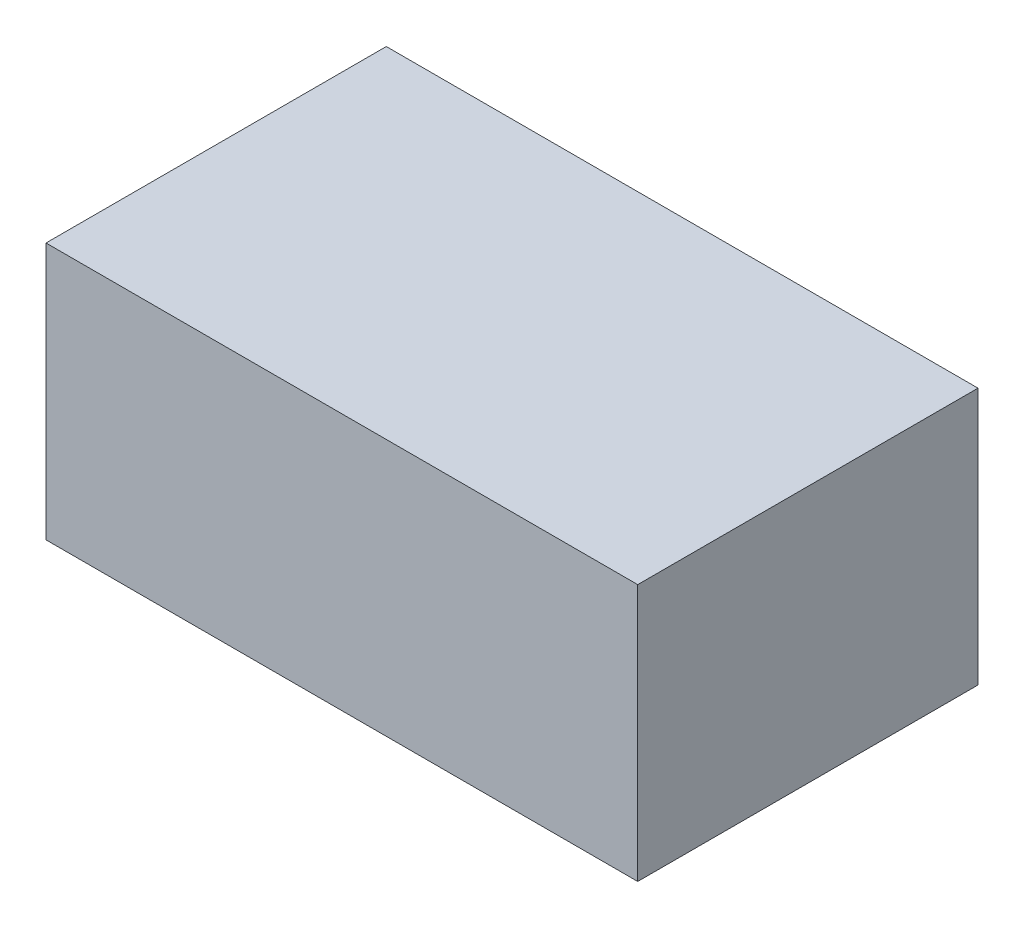
ISO-10303-21;
HEADER;
FILE_DESCRIPTION(('STEP AP214'),'2;1');
FILE_NAME('part.step','',(''),(''),'','','');
FILE_SCHEMA(('AUTOMOTIVE_DESIGN { 1 0 10303 214 1 1 1 1 }'));
ENDSEC;
DATA;
#1=APPLICATION_CONTEXT('core data for automotive mechanical design processes');
#2=APPLICATION_PROTOCOL_DEFINITION('international standard','automotive_design',2000,#1);
#3=PRODUCT_CONTEXT('',#1,'mechanical');
#4=PRODUCT('Part','Part','',(#3));
#5=PRODUCT_RELATED_PRODUCT_CATEGORY('part','',(#4));
#6=PRODUCT_DEFINITION_FORMATION('','',#4);
#7=PRODUCT_DEFINITION_CONTEXT('part definition',#1,'design');
#8=PRODUCT_DEFINITION('design','',#6,#7);
#9=PRODUCT_DEFINITION_SHAPE('','',#8);
#10=(LENGTH_UNIT() NAMED_UNIT(*) SI_UNIT(.MILLI.,.METRE.));
#11=(NAMED_UNIT(*) PLANE_ANGLE_UNIT() SI_UNIT($,.RADIAN.));
#12=(NAMED_UNIT(*) SI_UNIT($,.STERADIAN.) SOLID_ANGLE_UNIT());
#13=UNCERTAINTY_MEASURE_WITH_UNIT(LENGTH_MEASURE(1.E-05),#10,'distance_accuracy_value','');
#14=(GEOMETRIC_REPRESENTATION_CONTEXT(3) GLOBAL_UNCERTAINTY_ASSIGNED_CONTEXT((#13)) GLOBAL_UNIT_ASSIGNED_CONTEXT((#10,
#11,#12)) REPRESENTATION_CONTEXT('',''));
#15=CARTESIAN_POINT('',(0.,0.,0.));
#16=DIRECTION('',(0.,0.,1.));
#17=DIRECTION('',(1.,0.,0.));
#18=AXIS2_PLACEMENT_3D('',#15,#16,#17);
#19=CARTESIAN_POINT('',(19.8755,8.636,-11.43));
#20=DIRECTION('',(-1.,0.,0.));
#21=DIRECTION('',(0.,0.,1.));
#22=AXIS2_PLACEMENT_3D('',#19,#20,#21);
#23=PLANE('',#22);
#24=DIRECTION('',(0.,0.,-1.));
#25=VECTOR('',#24,1.);
#26=CARTESIAN_POINT('',(19.8755,-8.636,-11.43));
#27=LINE('',#26,#25);
#28=CARTESIAN_POINT('',(19.8755,-8.636,11.43));
#29=VERTEX_POINT('',#28);
#30=CARTESIAN_POINT('',(19.8755,-8.636,-11.43));
#31=VERTEX_POINT('',#30);
#32=EDGE_CURVE('E98',#29,#31,#27,.T.);
#33=ORIENTED_EDGE('',*,*,#32,.T.);
#34=DIRECTION('',(0.,-1.,0.));
#35=VECTOR('',#34,1.);
#36=CARTESIAN_POINT('',(19.8755,8.636,-11.43));
#37=LINE('',#36,#35);
#38=CARTESIAN_POINT('',(19.8755,8.636,-11.43));
#39=VERTEX_POINT('',#38);
#40=EDGE_CURVE('E11',#39,#31,#37,.T.);
#41=ORIENTED_EDGE('',*,*,#40,.F.);
#42=DIRECTION('',(0.,0.,-1.));
#43=VECTOR('',#42,1.);
#44=CARTESIAN_POINT('',(19.8755,8.636,-11.43));
#45=LINE('',#44,#43);
#46=CARTESIAN_POINT('',(19.8755,8.636,11.43));
#47=VERTEX_POINT('',#46);
#48=EDGE_CURVE('E86',#47,#39,#45,.T.);
#49=ORIENTED_EDGE('',*,*,#48,.F.);
#50=DIRECTION('',(0.,-1.,0.));
#51=VECTOR('',#50,1.);
#52=CARTESIAN_POINT('',(19.8755,8.636,11.43));
#53=LINE('',#52,#51);
#54=EDGE_CURVE('E94',#47,#29,#53,.T.);
#55=ORIENTED_EDGE('',*,*,#54,.T.);
#56=EDGE_LOOP('',(#33,#41,#49,#55));
#57=FACE_BOUND('',#56,.T.);
#58=ADVANCED_FACE('F35',(#57),#23,.F.);
#59=CARTESIAN_POINT('',(-19.8755,8.636,-11.43));
#60=DIRECTION('',(0.,0.,1.));
#61=DIRECTION('',(1.,0.,0.));
#62=AXIS2_PLACEMENT_3D('',#59,#60,#61);
#63=PLANE('',#62);
#64=DIRECTION('',(-1.,0.,0.));
#65=VECTOR('',#64,1.);
#66=CARTESIAN_POINT('',(-19.8755,-8.636,-11.43));
#67=LINE('',#66,#65);
#68=CARTESIAN_POINT('',(-19.8755,-8.636,-11.43));
#69=VERTEX_POINT('',#68);
#70=EDGE_CURVE('E90',#31,#69,#67,.T.);
#71=ORIENTED_EDGE('',*,*,#70,.T.);
#72=DIRECTION('',(0.,-1.,0.));
#73=VECTOR('',#72,1.);
#74=CARTESIAN_POINT('',(-19.8755,8.636,-11.43));
#75=LINE('',#74,#73);
#76=CARTESIAN_POINT('',(-19.8755,8.636,-11.43));
#77=VERTEX_POINT('',#76);
#78=EDGE_CURVE('E43',#77,#69,#75,.T.);
#79=ORIENTED_EDGE('',*,*,#78,.F.);
#80=DIRECTION('',(-1.,0.,0.));
#81=VECTOR('',#80,1.);
#82=CARTESIAN_POINT('',(-19.8755,8.636,-11.43));
#83=LINE('',#82,#81);
#84=EDGE_CURVE('E81',#39,#77,#83,.T.);
#85=ORIENTED_EDGE('',*,*,#84,.F.);
#86=ORIENTED_EDGE('',*,*,#40,.T.);
#87=EDGE_LOOP('',(#71,#79,#85,#86));
#88=FACE_BOUND('',#87,.T.);
#89=ADVANCED_FACE('F89',(#88),#63,.F.);
#90=CARTESIAN_POINT('',(-19.8755,8.636,-11.43));
#91=DIRECTION('',(1.,0.,0.));
#92=DIRECTION('',(0.,0.,-1.));
#93=AXIS2_PLACEMENT_3D('',#90,#91,#92);
#94=PLANE('',#93);
#95=DIRECTION('',(0.,0.,1.));
#96=VECTOR('',#95,1.);
#97=CARTESIAN_POINT('',(-19.8755,-8.636,-11.43));
#98=LINE('',#97,#96);
#99=CARTESIAN_POINT('',(-19.8755,-8.636,11.43));
#100=VERTEX_POINT('',#99);
#101=EDGE_CURVE('E68',#69,#100,#98,.T.);
#102=ORIENTED_EDGE('',*,*,#101,.T.);
#103=DIRECTION('',(0.,-1.,0.));
#104=VECTOR('',#103,1.);
#105=CARTESIAN_POINT('',(-19.8755,8.636,11.43));
#106=LINE('',#105,#104);
#107=CARTESIAN_POINT('',(-19.8755,8.636,11.43));
#108=VERTEX_POINT('',#107);
#109=EDGE_CURVE('E91',#108,#100,#106,.T.);
#110=ORIENTED_EDGE('',*,*,#109,.F.);
#111=DIRECTION('',(0.,0.,1.));
#112=VECTOR('',#111,1.);
#113=CARTESIAN_POINT('',(-19.8755,8.636,-11.43));
#114=LINE('',#113,#112);
#115=EDGE_CURVE('E84',#77,#108,#114,.T.);
#116=ORIENTED_EDGE('',*,*,#115,.F.);
#117=ORIENTED_EDGE('',*,*,#78,.T.);
#118=EDGE_LOOP('',(#102,#110,#116,#117));
#119=FACE_BOUND('',#118,.T.);
#120=ADVANCED_FACE('F92',(#119),#94,.F.);
#121=CARTESIAN_POINT('',(-19.8755,8.636,11.43));
#122=DIRECTION('',(0.,0.,-1.));
#123=DIRECTION('',(-1.,0.,0.));
#124=AXIS2_PLACEMENT_3D('',#121,#122,#123);
#125=PLANE('',#124);
#126=DIRECTION('',(1.,0.,0.));
#127=VECTOR('',#126,1.);
#128=CARTESIAN_POINT('',(-19.8755,-8.636,11.43));
#129=LINE('',#128,#127);
#130=EDGE_CURVE('E74',#100,#29,#129,.T.);
#131=ORIENTED_EDGE('',*,*,#130,.T.);
#132=ORIENTED_EDGE('',*,*,#54,.F.);
#133=DIRECTION('',(1.,0.,0.));
#134=VECTOR('',#133,1.);
#135=CARTESIAN_POINT('',(-19.8755,8.636,11.43));
#136=LINE('',#135,#134);
#137=EDGE_CURVE('E51',#108,#47,#136,.T.);
#138=ORIENTED_EDGE('',*,*,#137,.F.);
#139=ORIENTED_EDGE('',*,*,#109,.T.);
#140=EDGE_LOOP('',(#131,#132,#138,#139));
#141=FACE_BOUND('',#140,.T.);
#142=ADVANCED_FACE('F105',(#141),#125,.F.);
#143=CARTESIAN_POINT('',(0.,8.636,0.));
#144=DIRECTION('',(0.,1.,0.));
#145=DIRECTION('',(0.,0.,1.));
#146=AXIS2_PLACEMENT_3D('',#143,#144,#145);
#147=PLANE('',#146);
#148=ORIENTED_EDGE('',*,*,#48,.T.);
#149=ORIENTED_EDGE('',*,*,#84,.T.);
#150=ORIENTED_EDGE('',*,*,#115,.T.);
#151=ORIENTED_EDGE('',*,*,#137,.T.);
#152=EDGE_LOOP('',(#148,#149,#150,#151));
#153=FACE_BOUND('',#152,.T.);
#154=ADVANCED_FACE('F82',(#153),#147,.T.);
#155=CARTESIAN_POINT('',(0.,-8.636,0.));
#156=DIRECTION('',(0.,1.,0.));
#157=DIRECTION('',(0.,0.,1.));
#158=AXIS2_PLACEMENT_3D('',#155,#156,#157);
#159=PLANE('',#158);
#160=ORIENTED_EDGE('',*,*,#32,.F.);
#161=ORIENTED_EDGE('',*,*,#130,.F.);
#162=ORIENTED_EDGE('',*,*,#101,.F.);
#163=ORIENTED_EDGE('',*,*,#70,.F.);
#164=EDGE_LOOP('',(#160,#161,#162,#163));
#165=FACE_BOUND('',#164,.T.);
#166=ADVANCED_FACE('F108',(#165),#159,.F.);
#167=CLOSED_SHELL('',(#58,#89,#120,#142,#154,#166));
#168=MANIFOLD_SOLID_BREP('B2',#167);
#169=ADVANCED_BREP_SHAPE_REPRESENTATION('',(#18,#168),#14);
#170=SHAPE_DEFINITION_REPRESENTATION(#9,#169);
ENDSEC;
END-ISO-10303-21;
